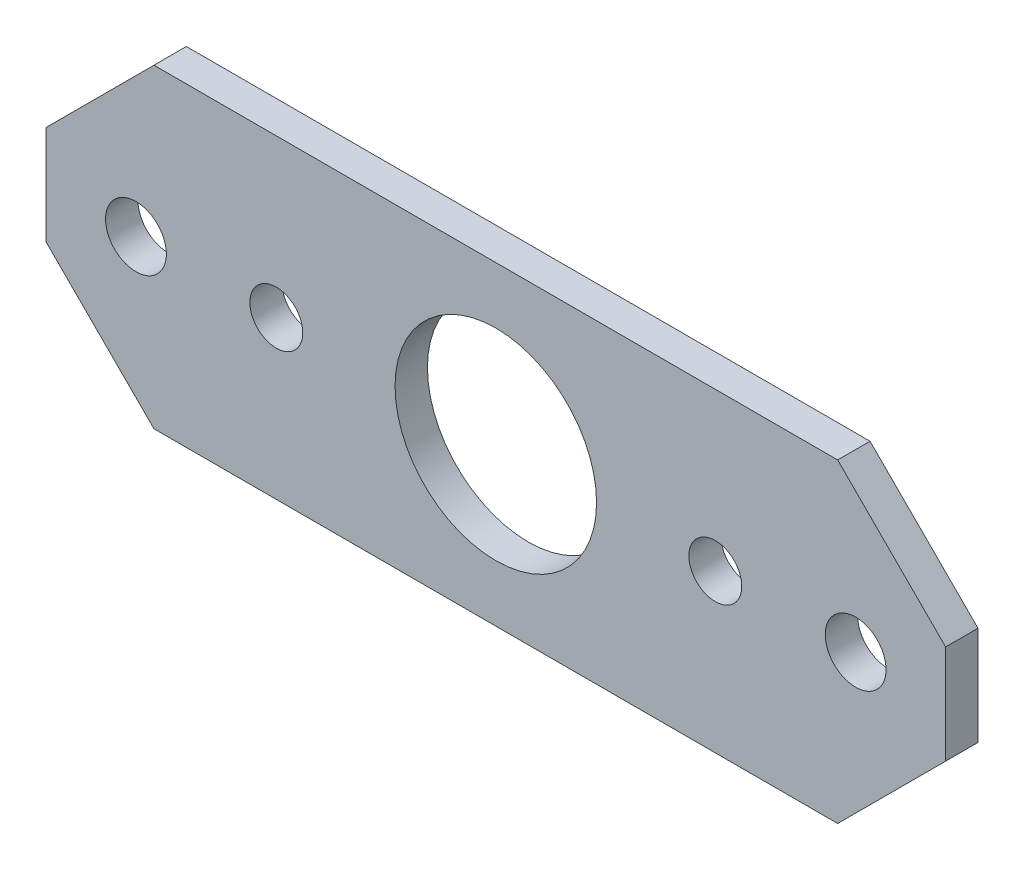
ISO-10303-21;
HEADER;
FILE_DESCRIPTION(('STEP AP214'),'2;1');
FILE_NAME('part.step','',(''),(''),'','','');
FILE_SCHEMA(('AUTOMOTIVE_DESIGN { 1 0 10303 214 1 1 1 1 }'));
ENDSEC;
DATA;
#1=APPLICATION_CONTEXT('core data for automotive mechanical design processes');
#2=APPLICATION_PROTOCOL_DEFINITION('international standard','automotive_design',2000,#1);
#3=PRODUCT_CONTEXT('',#1,'mechanical');
#4=PRODUCT('Part','Part','',(#3));
#5=PRODUCT_RELATED_PRODUCT_CATEGORY('part','',(#4));
#6=PRODUCT_DEFINITION_FORMATION('','',#4);
#7=PRODUCT_DEFINITION_CONTEXT('part definition',#1,'design');
#8=PRODUCT_DEFINITION('design','',#6,#7);
#9=PRODUCT_DEFINITION_SHAPE('','',#8);
#10=(LENGTH_UNIT() NAMED_UNIT(*) SI_UNIT(.MILLI.,.METRE.));
#11=(NAMED_UNIT(*) PLANE_ANGLE_UNIT() SI_UNIT($,.RADIAN.));
#12=(NAMED_UNIT(*) SI_UNIT($,.STERADIAN.) SOLID_ANGLE_UNIT());
#13=UNCERTAINTY_MEASURE_WITH_UNIT(LENGTH_MEASURE(1.E-05),#10,'distance_accuracy_value','');
#14=(GEOMETRIC_REPRESENTATION_CONTEXT(3) GLOBAL_UNCERTAINTY_ASSIGNED_CONTEXT((#13)) GLOBAL_UNIT_ASSIGNED_CONTEXT((#10,
#11,#12)) REPRESENTATION_CONTEXT('',''));
#15=CARTESIAN_POINT('',(0.,0.,0.));
#16=DIRECTION('',(0.,0.,1.));
#17=DIRECTION('',(1.,0.,0.));
#18=AXIS2_PLACEMENT_3D('',#15,#16,#17);
#19=CARTESIAN_POINT('',(-31.75,-11.1125,0.));
#20=DIRECTION('',(0.,0.,1.));
#21=DIRECTION('',(1.,0.,0.));
#22=AXIS2_PLACEMENT_3D('',#19,#20,#21);
#23=PLANE('',#22);
#24=DIRECTION('',(-0.707106781186548,0.707106781186548,0.));
#25=VECTOR('',#24,1.);
#26=CARTESIAN_POINT('',(-24.13,-11.1125,0.));
#27=LINE('',#26,#25);
#28=CARTESIAN_POINT('',(-24.13,-11.1125,0.));
#29=VERTEX_POINT('',#28);
#30=CARTESIAN_POINT('',(-31.75,-3.4925,0.));
#31=VERTEX_POINT('',#30);
#32=EDGE_CURVE('E81',#29,#31,#27,.T.);
#33=ORIENTED_EDGE('',*,*,#32,.T.);
#34=DIRECTION('',(0.,1.,0.));
#35=VECTOR('',#34,1.);
#36=CARTESIAN_POINT('',(-31.75,11.1125,0.));
#37=LINE('',#36,#35);
#38=CARTESIAN_POINT('',(-31.75,3.4925,0.));
#39=VERTEX_POINT('',#38);
#40=EDGE_CURVE('E84',#31,#39,#37,.T.);
#41=ORIENTED_EDGE('',*,*,#40,.T.);
#42=DIRECTION('',(0.707106781186547,0.707106781186548,0.));
#43=VECTOR('',#42,1.);
#44=CARTESIAN_POINT('',(-31.75,3.4925,0.));
#45=LINE('',#44,#43);
#46=CARTESIAN_POINT('',(-24.13,11.1125,0.));
#47=VERTEX_POINT('',#46);
#48=EDGE_CURVE('E335',#39,#47,#45,.T.);
#49=ORIENTED_EDGE('',*,*,#48,.T.);
#50=DIRECTION('',(1.,0.,0.));
#51=VECTOR('',#50,1.);
#52=CARTESIAN_POINT('',(-31.75,11.1125,0.));
#53=LINE('',#52,#51);
#54=CARTESIAN_POINT('',(24.13,11.1125,0.));
#55=VERTEX_POINT('',#54);
#56=EDGE_CURVE('E330',#47,#55,#53,.T.);
#57=ORIENTED_EDGE('',*,*,#56,.T.);
#58=DIRECTION('',(0.707106781186548,-0.707106781186547,0.));
#59=VECTOR('',#58,1.);
#60=CARTESIAN_POINT('',(24.13,11.1125,0.));
#61=LINE('',#60,#59);
#62=CARTESIAN_POINT('',(31.75,3.4925,0.));
#63=VERTEX_POINT('',#62);
#64=EDGE_CURVE('E326',#55,#63,#61,.T.);
#65=ORIENTED_EDGE('',*,*,#64,.T.);
#66=DIRECTION('',(0.,1.,0.));
#67=VECTOR('',#66,1.);
#68=CARTESIAN_POINT('',(31.75,11.1125,0.));
#69=LINE('',#68,#67);
#70=CARTESIAN_POINT('',(31.75,-3.4925,0.));
#71=VERTEX_POINT('',#70);
#72=EDGE_CURVE('E322',#63,#71,#69,.F.);
#73=ORIENTED_EDGE('',*,*,#72,.T.);
#74=DIRECTION('',(-0.707106781186548,-0.707106781186547,0.));
#75=VECTOR('',#74,1.);
#76=CARTESIAN_POINT('',(31.75,-3.4925,0.));
#77=LINE('',#76,#75);
#78=CARTESIAN_POINT('',(24.13,-11.1125,0.));
#79=VERTEX_POINT('',#78);
#80=EDGE_CURVE('E317',#71,#79,#77,.T.);
#81=ORIENTED_EDGE('',*,*,#80,.T.);
#82=DIRECTION('',(1.,0.,0.));
#83=VECTOR('',#82,1.);
#84=CARTESIAN_POINT('',(-31.75,-11.1125,0.));
#85=LINE('',#84,#83);
#86=EDGE_CURVE('E79',#79,#29,#85,.F.);
#87=ORIENTED_EDGE('',*,*,#86,.T.);
#88=EDGE_LOOP('',(#33,#41,#49,#57,#65,#73,#81,#87));
#89=FACE_BOUND('',#88,.T.);
#90=CARTESIAN_POINT('',(0.,0.,0.));
#91=DIRECTION('',(0.,0.,-1.));
#92=DIRECTION('',(-1.,0.,0.));
#93=AXIS2_PLACEMENT_3D('',#90,#91,#92);
#94=CIRCLE('',#93,7.112);
#95=CARTESIAN_POINT('',(-7.112,0.,0.));
#96=VERTEX_POINT('',#95);
#97=EDGE_CURVE('E97',#96,#96,#94,.F.);
#98=ORIENTED_EDGE('',*,*,#97,.T.);
#99=EDGE_LOOP('',(#98));
#100=FACE_BOUND('',#99,.T.);
#101=CARTESIAN_POINT('',(25.4,0.,0.));
#102=DIRECTION('',(0.,0.,-1.));
#103=DIRECTION('',(-1.,0.,0.));
#104=AXIS2_PLACEMENT_3D('',#101,#102,#103);
#105=CIRCLE('',#104,2.1463);
#106=CARTESIAN_POINT('',(23.2537,0.,0.));
#107=VERTEX_POINT('',#106);
#108=EDGE_CURVE('E126',#107,#107,#105,.F.);
#109=ORIENTED_EDGE('',*,*,#108,.T.);
#110=EDGE_LOOP('',(#109));
#111=FACE_BOUND('',#110,.T.);
#112=CARTESIAN_POINT('',(-25.4,0.,0.));
#113=DIRECTION('',(0.,0.,-1.));
#114=DIRECTION('',(-1.,0.,0.));
#115=AXIS2_PLACEMENT_3D('',#112,#113,#114);
#116=CIRCLE('',#115,2.1463);
#117=CARTESIAN_POINT('',(-27.5463,0.,0.));
#118=VERTEX_POINT('',#117);
#119=EDGE_CURVE('E129',#118,#118,#116,.F.);
#120=ORIENTED_EDGE('',*,*,#119,.T.);
#121=EDGE_LOOP('',(#120));
#122=FACE_BOUND('',#121,.T.);
#123=CARTESIAN_POINT('',(15.494,0.,0.));
#124=DIRECTION('',(0.,0.,-1.));
#125=DIRECTION('',(-1.,0.,0.));
#126=AXIS2_PLACEMENT_3D('',#123,#124,#125);
#127=CIRCLE('',#126,1.8669);
#128=CARTESIAN_POINT('',(13.6271,0.,0.));
#129=VERTEX_POINT('',#128);
#130=EDGE_CURVE('E131',#129,#129,#127,.F.);
#131=ORIENTED_EDGE('',*,*,#130,.T.);
#132=EDGE_LOOP('',(#131));
#133=FACE_BOUND('',#132,.T.);
#134=CARTESIAN_POINT('',(-15.494,0.,0.));
#135=DIRECTION('',(0.,0.,-1.));
#136=DIRECTION('',(-1.,0.,0.));
#137=AXIS2_PLACEMENT_3D('',#134,#135,#136);
#138=CIRCLE('',#137,1.8669);
#139=CARTESIAN_POINT('',(-17.3609,0.,0.));
#140=VERTEX_POINT('',#139);
#141=EDGE_CURVE('E19',#140,#140,#138,.F.);
#142=ORIENTED_EDGE('',*,*,#141,.T.);
#143=EDGE_LOOP('',(#142));
#144=FACE_BOUND('',#143,.T.);
#145=ADVANCED_FACE('F16',(#89,#100,#111,#122,#133,#144),#23,.F.);
#146=CARTESIAN_POINT('',(-15.494,0.,2.286));
#147=DIRECTION('',(0.,0.,-1.));
#148=DIRECTION('',(-1.,0.,0.));
#149=AXIS2_PLACEMENT_3D('',#146,#147,#148);
#150=CYLINDRICAL_SURFACE('',#149,1.8669);
#151=ORIENTED_EDGE('',*,*,#141,.F.);
#152=EDGE_LOOP('',(#151));
#153=FACE_BOUND('',#152,.T.);
#154=CARTESIAN_POINT('',(-15.494,0.,2.286));
#155=DIRECTION('',(0.,0.,-1.));
#156=DIRECTION('',(-1.,0.,0.));
#157=AXIS2_PLACEMENT_3D('',#154,#155,#156);
#158=CIRCLE('',#157,1.8669);
#159=CARTESIAN_POINT('',(-17.3609,0.,2.286));
#160=VERTEX_POINT('',#159);
#161=EDGE_CURVE('E121',#160,#160,#158,.T.);
#162=ORIENTED_EDGE('',*,*,#161,.F.);
#163=EDGE_LOOP('',(#162));
#164=FACE_BOUND('',#163,.T.);
#165=ADVANCED_FACE('F139',(#153,#164),#150,.F.);
#166=CARTESIAN_POINT('',(15.494,0.,2.286));
#167=DIRECTION('',(0.,0.,-1.));
#168=DIRECTION('',(-1.,0.,0.));
#169=AXIS2_PLACEMENT_3D('',#166,#167,#168);
#170=CYLINDRICAL_SURFACE('',#169,1.8669);
#171=ORIENTED_EDGE('',*,*,#130,.F.);
#172=EDGE_LOOP('',(#171));
#173=FACE_BOUND('',#172,.T.);
#174=CARTESIAN_POINT('',(15.494,0.,2.286));
#175=DIRECTION('',(0.,0.,-1.));
#176=DIRECTION('',(-1.,0.,0.));
#177=AXIS2_PLACEMENT_3D('',#174,#175,#176);
#178=CIRCLE('',#177,1.8669);
#179=CARTESIAN_POINT('',(13.6271,0.,2.286));
#180=VERTEX_POINT('',#179);
#181=EDGE_CURVE('E118',#180,#180,#178,.T.);
#182=ORIENTED_EDGE('',*,*,#181,.F.);
#183=EDGE_LOOP('',(#182));
#184=FACE_BOUND('',#183,.T.);
#185=ADVANCED_FACE('F142',(#173,#184),#170,.F.);
#186=CARTESIAN_POINT('',(-25.4,0.,2.286));
#187=DIRECTION('',(0.,0.,-1.));
#188=DIRECTION('',(-1.,0.,0.));
#189=AXIS2_PLACEMENT_3D('',#186,#187,#188);
#190=CYLINDRICAL_SURFACE('',#189,2.1463);
#191=ORIENTED_EDGE('',*,*,#119,.F.);
#192=EDGE_LOOP('',(#191));
#193=FACE_BOUND('',#192,.T.);
#194=CARTESIAN_POINT('',(-25.4,0.,2.286));
#195=DIRECTION('',(0.,0.,-1.));
#196=DIRECTION('',(-1.,0.,0.));
#197=AXIS2_PLACEMENT_3D('',#194,#195,#196);
#198=CIRCLE('',#197,2.1463);
#199=CARTESIAN_POINT('',(-27.5463,0.,2.286));
#200=VERTEX_POINT('',#199);
#201=EDGE_CURVE('E115',#200,#200,#198,.T.);
#202=ORIENTED_EDGE('',*,*,#201,.F.);
#203=EDGE_LOOP('',(#202));
#204=FACE_BOUND('',#203,.T.);
#205=ADVANCED_FACE('F189',(#193,#204),#190,.F.);
#206=CARTESIAN_POINT('',(25.4,0.,2.286));
#207=DIRECTION('',(0.,0.,-1.));
#208=DIRECTION('',(-1.,0.,0.));
#209=AXIS2_PLACEMENT_3D('',#206,#207,#208);
#210=CYLINDRICAL_SURFACE('',#209,2.1463);
#211=ORIENTED_EDGE('',*,*,#108,.F.);
#212=EDGE_LOOP('',(#211));
#213=FACE_BOUND('',#212,.T.);
#214=CARTESIAN_POINT('',(25.4,0.,2.286));
#215=DIRECTION('',(0.,0.,-1.));
#216=DIRECTION('',(-1.,0.,0.));
#217=AXIS2_PLACEMENT_3D('',#214,#215,#216);
#218=CIRCLE('',#217,2.1463);
#219=CARTESIAN_POINT('',(23.2537,0.,2.286));
#220=VERTEX_POINT('',#219);
#221=EDGE_CURVE('E112',#220,#220,#218,.T.);
#222=ORIENTED_EDGE('',*,*,#221,.F.);
#223=EDGE_LOOP('',(#222));
#224=FACE_BOUND('',#223,.T.);
#225=ADVANCED_FACE('F185',(#213,#224),#210,.F.);
#226=CARTESIAN_POINT('',(0.,0.,2.286));
#227=DIRECTION('',(0.,0.,-1.));
#228=DIRECTION('',(-1.,0.,0.));
#229=AXIS2_PLACEMENT_3D('',#226,#227,#228);
#230=CYLINDRICAL_SURFACE('',#229,7.112);
#231=ORIENTED_EDGE('',*,*,#97,.F.);
#232=EDGE_LOOP('',(#231));
#233=FACE_BOUND('',#232,.T.);
#234=CARTESIAN_POINT('',(0.,0.,2.286));
#235=DIRECTION('',(0.,0.,-1.));
#236=DIRECTION('',(-1.,0.,0.));
#237=AXIS2_PLACEMENT_3D('',#234,#235,#236);
#238=CIRCLE('',#237,7.112);
#239=CARTESIAN_POINT('',(-7.112,0.,2.286));
#240=VERTEX_POINT('',#239);
#241=EDGE_CURVE('E108',#240,#240,#238,.T.);
#242=ORIENTED_EDGE('',*,*,#241,.F.);
#243=EDGE_LOOP('',(#242));
#244=FACE_BOUND('',#243,.T.);
#245=ADVANCED_FACE('F182',(#233,#244),#230,.F.);
#246=CARTESIAN_POINT('',(-31.75,11.1125,2.286));
#247=DIRECTION('',(1.,0.,0.));
#248=DIRECTION('',(0.,0.,-1.));
#249=AXIS2_PLACEMENT_3D('',#246,#247,#248);
#250=PLANE('',#249);
#251=DIRECTION('',(0.,0.,1.));
#252=VECTOR('',#251,1.);
#253=CARTESIAN_POINT('',(-31.75,-3.4925,2.286));
#254=LINE('',#253,#252);
#255=CARTESIAN_POINT('',(-31.75,-3.4925,2.286));
#256=VERTEX_POINT('',#255);
#257=EDGE_CURVE('E89',#31,#256,#254,.T.);
#258=ORIENTED_EDGE('',*,*,#257,.T.);
#259=DIRECTION('',(0.,1.,0.));
#260=VECTOR('',#259,1.);
#261=CARTESIAN_POINT('',(-31.75,-11.1125,2.286));
#262=LINE('',#261,#260);
#263=CARTESIAN_POINT('',(-31.75,3.4925,2.286));
#264=VERTEX_POINT('',#263);
#265=EDGE_CURVE('E111',#264,#256,#262,.F.);
#266=ORIENTED_EDGE('',*,*,#265,.F.);
#267=DIRECTION('',(0.,0.,1.));
#268=VECTOR('',#267,1.);
#269=CARTESIAN_POINT('',(-31.75,3.4925,2.286));
#270=LINE('',#269,#268);
#271=EDGE_CURVE('E95',#264,#39,#270,.F.);
#272=ORIENTED_EDGE('',*,*,#271,.T.);
#273=ORIENTED_EDGE('',*,*,#40,.F.);
#274=EDGE_LOOP('',(#258,#266,#272,#273));
#275=FACE_BOUND('',#274,.T.);
#276=ADVANCED_FACE('F92',(#275),#250,.F.);
#277=CARTESIAN_POINT('',(-24.13,-11.1125,2.286));
#278=DIRECTION('',(0.707106781186548,0.707106781186548,0.));
#279=DIRECTION('',(-0.707106781186548,0.707106781186548,0.));
#280=AXIS2_PLACEMENT_3D('',#277,#278,#279);
#281=PLANE('',#280);
#282=ORIENTED_EDGE('',*,*,#257,.F.);
#283=ORIENTED_EDGE('',*,*,#32,.F.);
#284=DIRECTION('',(0.,0.,1.));
#285=VECTOR('',#284,1.);
#286=CARTESIAN_POINT('',(-24.13,-11.1125,2.286));
#287=LINE('',#286,#285);
#288=CARTESIAN_POINT('',(-24.13,-11.1125,2.286));
#289=VERTEX_POINT('',#288);
#290=EDGE_CURVE('E104',#29,#289,#287,.T.);
#291=ORIENTED_EDGE('',*,*,#290,.T.);
#292=DIRECTION('',(0.707106781186547,-0.707106781186548,0.));
#293=VECTOR('',#292,1.);
#294=CARTESIAN_POINT('',(-31.75,-3.49249999999999,2.286));
#295=LINE('',#294,#293);
#296=EDGE_CURVE('E101',#256,#289,#295,.T.);
#297=ORIENTED_EDGE('',*,*,#296,.F.);
#298=EDGE_LOOP('',(#282,#283,#291,#297));
#299=FACE_BOUND('',#298,.T.);
#300=ADVANCED_FACE('F99',(#299),#281,.F.);
#301=CARTESIAN_POINT('',(-31.75,-11.1125,2.286));
#302=DIRECTION('',(0.,1.,0.));
#303=DIRECTION('',(0.,0.,1.));
#304=AXIS2_PLACEMENT_3D('',#301,#302,#303);
#305=PLANE('',#304);
#306=ORIENTED_EDGE('',*,*,#290,.F.);
#307=ORIENTED_EDGE('',*,*,#86,.F.);
#308=DIRECTION('',(0.,0.,1.));
#309=VECTOR('',#308,1.);
#310=CARTESIAN_POINT('',(24.13,-11.1125,2.286));
#311=LINE('',#310,#309);
#312=CARTESIAN_POINT('',(24.13,-11.1125,2.286));
#313=VERTEX_POINT('',#312);
#314=EDGE_CURVE('E318',#79,#313,#311,.T.);
#315=ORIENTED_EDGE('',*,*,#314,.T.);
#316=DIRECTION('',(1.,0.,0.));
#317=VECTOR('',#316,1.);
#318=CARTESIAN_POINT('',(-31.75,-11.1125,2.286));
#319=LINE('',#318,#317);
#320=EDGE_CURVE('E316',#289,#313,#319,.T.);
#321=ORIENTED_EDGE('',*,*,#320,.F.);
#322=EDGE_LOOP('',(#306,#307,#315,#321));
#323=FACE_BOUND('',#322,.T.);
#324=ADVANCED_FACE('F173',(#323),#305,.F.);
#325=CARTESIAN_POINT('',(31.75,-3.4925,2.286));
#326=DIRECTION('',(-0.707106781186547,0.707106781186548,0.));
#327=DIRECTION('',(-0.707106781186548,-0.707106781186547,0.));
#328=AXIS2_PLACEMENT_3D('',#325,#326,#327);
#329=PLANE('',#328);
#330=ORIENTED_EDGE('',*,*,#314,.F.);
#331=ORIENTED_EDGE('',*,*,#80,.F.);
#332=DIRECTION('',(0.,0.,1.));
#333=VECTOR('',#332,1.);
#334=CARTESIAN_POINT('',(31.75,-3.4925,2.286));
#335=LINE('',#334,#333);
#336=CARTESIAN_POINT('',(31.75,-3.4925,2.286));
#337=VERTEX_POINT('',#336);
#338=EDGE_CURVE('E324',#71,#337,#335,.T.);
#339=ORIENTED_EDGE('',*,*,#338,.T.);
#340=DIRECTION('',(0.707106781186548,0.707106781186547,0.));
#341=VECTOR('',#340,1.);
#342=CARTESIAN_POINT('',(24.13,-11.1125,2.286));
#343=LINE('',#342,#341);
#344=EDGE_CURVE('E341',#313,#337,#343,.T.);
#345=ORIENTED_EDGE('',*,*,#344,.F.);
#346=EDGE_LOOP('',(#330,#331,#339,#345));
#347=FACE_BOUND('',#346,.T.);
#348=ADVANCED_FACE('F169',(#347),#329,.F.);
#349=CARTESIAN_POINT('',(31.75,11.1125,2.286));
#350=DIRECTION('',(-1.,0.,0.));
#351=DIRECTION('',(0.,0.,1.));
#352=AXIS2_PLACEMENT_3D('',#349,#350,#351);
#353=PLANE('',#352);
#354=ORIENTED_EDGE('',*,*,#338,.F.);
#355=ORIENTED_EDGE('',*,*,#72,.F.);
#356=DIRECTION('',(0.,0.,1.));
#357=VECTOR('',#356,1.);
#358=CARTESIAN_POINT('',(31.75,3.4925,2.286));
#359=LINE('',#358,#357);
#360=CARTESIAN_POINT('',(31.75,3.4925,2.286));
#361=VERTEX_POINT('',#360);
#362=EDGE_CURVE('E328',#63,#361,#359,.T.);
#363=ORIENTED_EDGE('',*,*,#362,.T.);
#364=DIRECTION('',(0.,1.,0.));
#365=VECTOR('',#364,1.);
#366=CARTESIAN_POINT('',(31.75,-11.1125,2.286));
#367=LINE('',#366,#365);
#368=EDGE_CURVE('E344',#337,#361,#367,.T.);
#369=ORIENTED_EDGE('',*,*,#368,.F.);
#370=EDGE_LOOP('',(#354,#355,#363,#369));
#371=FACE_BOUND('',#370,.T.);
#372=ADVANCED_FACE('F165',(#371),#353,.F.);
#373=CARTESIAN_POINT('',(24.13,11.1125,2.286));
#374=DIRECTION('',(-0.707106781186547,-0.707106781186548,0.));
#375=DIRECTION('',(0.707106781186548,-0.707106781186547,0.));
#376=AXIS2_PLACEMENT_3D('',#373,#374,#375);
#377=PLANE('',#376);
#378=ORIENTED_EDGE('',*,*,#362,.F.);
#379=ORIENTED_EDGE('',*,*,#64,.F.);
#380=DIRECTION('',(0.,0.,-1.));
#381=VECTOR('',#380,1.);
#382=CARTESIAN_POINT('',(24.13,11.1125,2.286));
#383=LINE('',#382,#381);
#384=CARTESIAN_POINT('',(24.13,11.1125,2.286));
#385=VERTEX_POINT('',#384);
#386=EDGE_CURVE('E332',#55,#385,#383,.F.);
#387=ORIENTED_EDGE('',*,*,#386,.T.);
#388=DIRECTION('',(-0.707106781186547,0.707106781186547,0.));
#389=VECTOR('',#388,1.);
#390=CARTESIAN_POINT('',(31.75,3.49249999999999,2.286));
#391=LINE('',#390,#389);
#392=EDGE_CURVE('E347',#361,#385,#391,.T.);
#393=ORIENTED_EDGE('',*,*,#392,.F.);
#394=EDGE_LOOP('',(#378,#379,#387,#393));
#395=FACE_BOUND('',#394,.T.);
#396=ADVANCED_FACE('F162',(#395),#377,.F.);
#397=CARTESIAN_POINT('',(-31.75,11.1125,2.286));
#398=DIRECTION('',(0.,-1.,0.));
#399=DIRECTION('',(0.,0.,-1.));
#400=AXIS2_PLACEMENT_3D('',#397,#398,#399);
#401=PLANE('',#400);
#402=ORIENTED_EDGE('',*,*,#386,.F.);
#403=ORIENTED_EDGE('',*,*,#56,.F.);
#404=DIRECTION('',(0.,0.,1.));
#405=VECTOR('',#404,1.);
#406=CARTESIAN_POINT('',(-24.13,11.1125,2.286));
#407=LINE('',#406,#405);
#408=CARTESIAN_POINT('',(-24.13,11.1125,2.286));
#409=VERTEX_POINT('',#408);
#410=EDGE_CURVE('E34',#47,#409,#407,.T.);
#411=ORIENTED_EDGE('',*,*,#410,.T.);
#412=DIRECTION('',(1.,0.,0.));
#413=VECTOR('',#412,1.);
#414=CARTESIAN_POINT('',(-31.75,11.1125,2.286));
#415=LINE('',#414,#413);
#416=EDGE_CURVE('E25',#385,#409,#415,.F.);
#417=ORIENTED_EDGE('',*,*,#416,.F.);
#418=EDGE_LOOP('',(#402,#403,#411,#417));
#419=FACE_BOUND('',#418,.T.);
#420=ADVANCED_FACE('F154',(#419),#401,.F.);
#421=CARTESIAN_POINT('',(-31.75,3.4925,2.286));
#422=DIRECTION('',(0.707106781186548,-0.707106781186547,0.));
#423=DIRECTION('',(0.707106781186547,0.707106781186548,0.));
#424=AXIS2_PLACEMENT_3D('',#421,#422,#423);
#425=PLANE('',#424);
#426=ORIENTED_EDGE('',*,*,#410,.F.);
#427=ORIENTED_EDGE('',*,*,#48,.F.);
#428=ORIENTED_EDGE('',*,*,#271,.F.);
#429=DIRECTION('',(-0.707106781186547,-0.707106781186548,0.));
#430=VECTOR('',#429,1.);
#431=CARTESIAN_POINT('',(-24.13,11.1125,2.286));
#432=LINE('',#431,#430);
#433=EDGE_CURVE('E11',#409,#264,#432,.T.);
#434=ORIENTED_EDGE('',*,*,#433,.F.);
#435=EDGE_LOOP('',(#426,#427,#428,#434));
#436=FACE_BOUND('',#435,.T.);
#437=ADVANCED_FACE('F147',(#436),#425,.F.);
#438=CARTESIAN_POINT('',(-31.75,-11.1125,2.286));
#439=DIRECTION('',(0.,0.,1.));
#440=DIRECTION('',(1.,0.,0.));
#441=AXIS2_PLACEMENT_3D('',#438,#439,#440);
#442=PLANE('',#441);
#443=ORIENTED_EDGE('',*,*,#416,.T.);
#444=ORIENTED_EDGE('',*,*,#433,.T.);
#445=ORIENTED_EDGE('',*,*,#265,.T.);
#446=ORIENTED_EDGE('',*,*,#296,.T.);
#447=ORIENTED_EDGE('',*,*,#320,.T.);
#448=ORIENTED_EDGE('',*,*,#344,.T.);
#449=ORIENTED_EDGE('',*,*,#368,.T.);
#450=ORIENTED_EDGE('',*,*,#392,.T.);
#451=EDGE_LOOP('',(#443,#444,#445,#446,#447,#448,#449,#450));
#452=FACE_BOUND('',#451,.T.);
#453=ORIENTED_EDGE('',*,*,#241,.T.);
#454=EDGE_LOOP('',(#453));
#455=FACE_BOUND('',#454,.T.);
#456=ORIENTED_EDGE('',*,*,#221,.T.);
#457=EDGE_LOOP('',(#456));
#458=FACE_BOUND('',#457,.T.);
#459=ORIENTED_EDGE('',*,*,#201,.T.);
#460=EDGE_LOOP('',(#459));
#461=FACE_BOUND('',#460,.T.);
#462=ORIENTED_EDGE('',*,*,#181,.T.);
#463=EDGE_LOOP('',(#462));
#464=FACE_BOUND('',#463,.T.);
#465=ORIENTED_EDGE('',*,*,#161,.T.);
#466=EDGE_LOOP('',(#465));
#467=FACE_BOUND('',#466,.T.);
#468=ADVANCED_FACE('F145',(#452,#455,#458,#461,#464,#467),#442,.T.);
#469=CLOSED_SHELL('',(#145,#165,#185,#205,#225,#245,#276,#300,#324,#348,#372,#396,#420,#437,#468));
#470=MANIFOLD_SOLID_BREP('B1',#469);
#471=ADVANCED_BREP_SHAPE_REPRESENTATION('',(#18,#470),#14);
#472=SHAPE_DEFINITION_REPRESENTATION(#9,#471);
ENDSEC;
END-ISO-10303-21;
